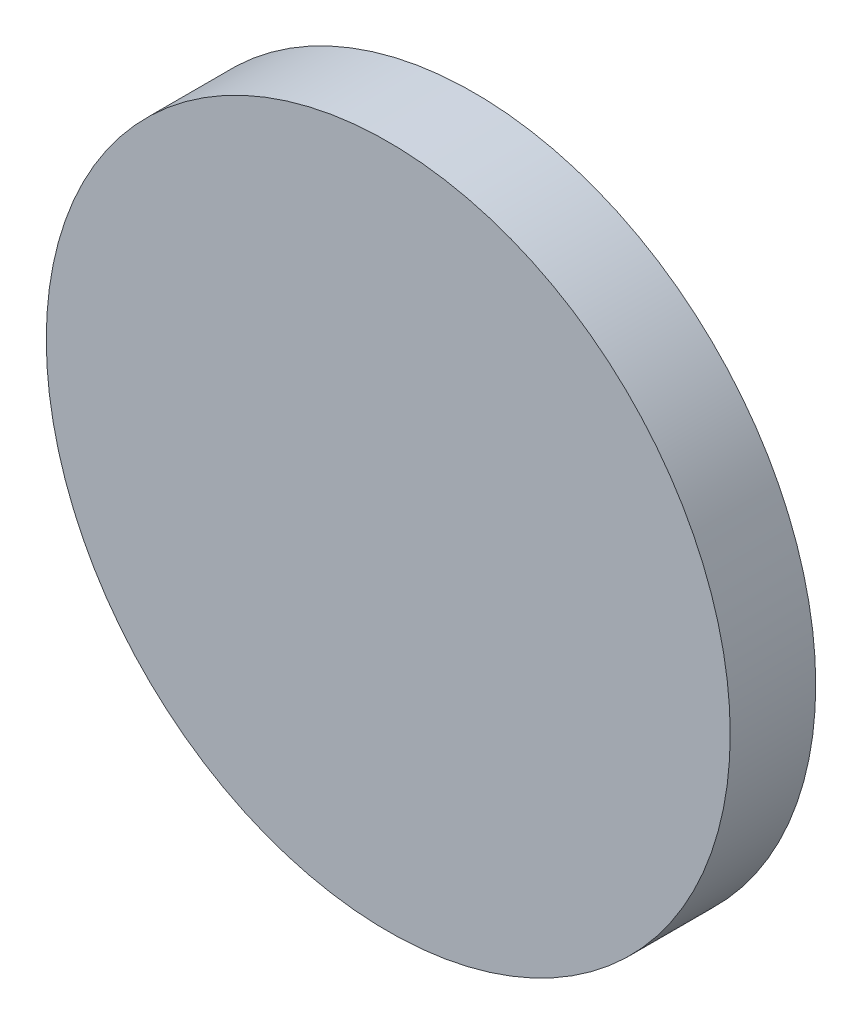
ISO-10303-21;
HEADER;
FILE_DESCRIPTION(('STEP AP214'),'2;1');
FILE_NAME('part.step','',(''),(''),'','','');
FILE_SCHEMA(('AUTOMOTIVE_DESIGN { 1 0 10303 214 1 1 1 1 }'));
ENDSEC;
DATA;
#1=APPLICATION_CONTEXT('core data for automotive mechanical design processes');
#2=APPLICATION_PROTOCOL_DEFINITION('international standard','automotive_design',2000,#1);
#3=PRODUCT_CONTEXT('',#1,'mechanical');
#4=PRODUCT('Part','Part','',(#3));
#5=PRODUCT_RELATED_PRODUCT_CATEGORY('part','',(#4));
#6=PRODUCT_DEFINITION_FORMATION('','',#4);
#7=PRODUCT_DEFINITION_CONTEXT('part definition',#1,'design');
#8=PRODUCT_DEFINITION('design','',#6,#7);
#9=PRODUCT_DEFINITION_SHAPE('','',#8);
#10=(LENGTH_UNIT() NAMED_UNIT(*) SI_UNIT(.MILLI.,.METRE.));
#11=(NAMED_UNIT(*) PLANE_ANGLE_UNIT() SI_UNIT($,.RADIAN.));
#12=(NAMED_UNIT(*) SI_UNIT($,.STERADIAN.) SOLID_ANGLE_UNIT());
#13=UNCERTAINTY_MEASURE_WITH_UNIT(LENGTH_MEASURE(1.E-05),#10,'distance_accuracy_value','');
#14=(GEOMETRIC_REPRESENTATION_CONTEXT(3) GLOBAL_UNCERTAINTY_ASSIGNED_CONTEXT((#13)) GLOBAL_UNIT_ASSIGNED_CONTEXT((#10,
#11,#12)) REPRESENTATION_CONTEXT('',''));
#15=CARTESIAN_POINT('',(0.,0.,0.));
#16=DIRECTION('',(0.,0.,1.));
#17=DIRECTION('',(1.,0.,0.));
#18=AXIS2_PLACEMENT_3D('',#15,#16,#17);
#19=CARTESIAN_POINT('',(0.,0.,6.35));
#20=DIRECTION('',(0.,0.,-1.));
#21=DIRECTION('',(-1.,0.,0.));
#22=AXIS2_PLACEMENT_3D('',#19,#20,#21);
#23=CYLINDRICAL_SURFACE('',#22,25.4);
#24=CARTESIAN_POINT('',(0.,0.,6.35));
#25=DIRECTION('',(0.,0.,1.));
#26=DIRECTION('',(1.,0.,0.));
#27=AXIS2_PLACEMENT_3D('',#24,#25,#26);
#28=CIRCLE('',#27,25.4);
#29=CARTESIAN_POINT('',(25.4,0.,6.35));
#30=VERTEX_POINT('',#29);
#31=EDGE_CURVE('E10',#30,#30,#28,.T.);
#32=ORIENTED_EDGE('',*,*,#31,.F.);
#33=EDGE_LOOP('',(#32));
#34=FACE_BOUND('',#33,.T.);
#35=CARTESIAN_POINT('',(0.,0.,0.));
#36=DIRECTION('',(0.,0.,1.));
#37=DIRECTION('',(1.,0.,0.));
#38=AXIS2_PLACEMENT_3D('',#35,#36,#37);
#39=CIRCLE('',#38,25.4);
#40=CARTESIAN_POINT('',(25.4,0.,0.));
#41=VERTEX_POINT('',#40);
#42=EDGE_CURVE('E34',#41,#41,#39,.T.);
#43=ORIENTED_EDGE('',*,*,#42,.T.);
#44=EDGE_LOOP('',(#43));
#45=FACE_BOUND('',#44,.T.);
#46=ADVANCED_FACE('F31',(#34,#45),#23,.T.);
#47=CARTESIAN_POINT('',(0.,0.,6.35));
#48=DIRECTION('',(0.,0.,1.));
#49=DIRECTION('',(1.,0.,0.));
#50=AXIS2_PLACEMENT_3D('',#47,#48,#49);
#51=PLANE('',#50);
#52=ORIENTED_EDGE('',*,*,#31,.T.);
#53=EDGE_LOOP('',(#52));
#54=FACE_BOUND('',#53,.T.);
#55=ADVANCED_FACE('F46',(#54),#51,.T.);
#56=CARTESIAN_POINT('',(0.,0.,0.));
#57=DIRECTION('',(0.,0.,1.));
#58=DIRECTION('',(1.,0.,0.));
#59=AXIS2_PLACEMENT_3D('',#56,#57,#58);
#60=PLANE('',#59);
#61=ORIENTED_EDGE('',*,*,#42,.F.);
#62=EDGE_LOOP('',(#61));
#63=FACE_BOUND('',#62,.T.);
#64=ADVANCED_FACE('F44',(#63),#60,.F.);
#65=CLOSED_SHELL('',(#46,#55,#64));
#66=MANIFOLD_SOLID_BREP('B2',#65);
#67=ADVANCED_BREP_SHAPE_REPRESENTATION('',(#18,#66),#14);
#68=SHAPE_DEFINITION_REPRESENTATION(#9,#67);
ENDSEC;
END-ISO-10303-21;
